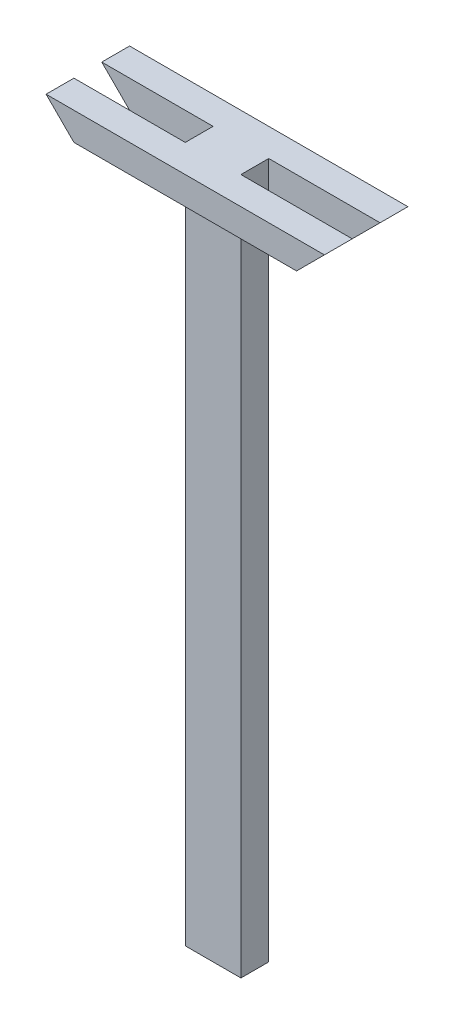
ISO-10303-21;
HEADER;
FILE_DESCRIPTION(('STEP AP214'),'2;1');
FILE_NAME('part.step','',(''),(''),'','','');
FILE_SCHEMA(('AUTOMOTIVE_DESIGN { 1 0 10303 214 1 1 1 1 }'));
ENDSEC;
DATA;
#1=APPLICATION_CONTEXT('core data for automotive mechanical design processes');
#2=APPLICATION_PROTOCOL_DEFINITION('international standard','automotive_design',2000,#1);
#3=PRODUCT_CONTEXT('',#1,'mechanical');
#4=PRODUCT('Part','Part','',(#3));
#5=PRODUCT_RELATED_PRODUCT_CATEGORY('part','',(#4));
#6=PRODUCT_DEFINITION_FORMATION('','',#4);
#7=PRODUCT_DEFINITION_CONTEXT('part definition',#1,'design');
#8=PRODUCT_DEFINITION('design','',#6,#7);
#9=PRODUCT_DEFINITION_SHAPE('','',#8);
#10=(LENGTH_UNIT() NAMED_UNIT(*) SI_UNIT(.MILLI.,.METRE.));
#11=(NAMED_UNIT(*) PLANE_ANGLE_UNIT() SI_UNIT($,.RADIAN.));
#12=(NAMED_UNIT(*) SI_UNIT($,.STERADIAN.) SOLID_ANGLE_UNIT());
#13=UNCERTAINTY_MEASURE_WITH_UNIT(LENGTH_MEASURE(1.E-05),#10,'distance_accuracy_value','');
#14=(GEOMETRIC_REPRESENTATION_CONTEXT(3) GLOBAL_UNCERTAINTY_ASSIGNED_CONTEXT((#13)) GLOBAL_UNIT_ASSIGNED_CONTEXT((#10,
#11,#12)) REPRESENTATION_CONTEXT('',''));
#15=CARTESIAN_POINT('',(0.,0.,0.));
#16=DIRECTION('',(0.,0.,1.));
#17=DIRECTION('',(1.,0.,0.));
#18=AXIS2_PLACEMENT_3D('',#15,#16,#17);
#19=CARTESIAN_POINT('',(0.,1000.,0.));
#20=DIRECTION('',(0.,0.,1.));
#21=DIRECTION('',(1.,0.,0.));
#22=AXIS2_PLACEMENT_3D('',#19,#20,#21);
#23=PLANE('',#22);
#24=DIRECTION('',(-1.,0.,0.));
#25=VECTOR('',#24,1.);
#26=CARTESIAN_POINT('',(240.,960.,0.));
#27=LINE('',#26,#25);
#28=CARTESIAN_POINT('',(80.,960.,0.));
#29=VERTEX_POINT('',#28);
#30=CARTESIAN_POINT('',(0.,960.,0.));
#31=VERTEX_POINT('',#30);
#32=EDGE_CURVE('E43',#29,#31,#27,.T.);
#33=ORIENTED_EDGE('',*,*,#32,.F.);
#34=DIRECTION('',(0.,-1.,0.));
#35=VECTOR('',#34,1.);
#36=CARTESIAN_POINT('',(80.,1000.,0.));
#37=LINE('',#36,#35);
#38=CARTESIAN_POINT('',(80.,0.,0.));
#39=VERTEX_POINT('',#38);
#40=EDGE_CURVE('E215',#29,#39,#37,.T.);
#41=ORIENTED_EDGE('',*,*,#40,.T.);
#42=DIRECTION('',(-1.,0.,0.));
#43=VECTOR('',#42,1.);
#44=CARTESIAN_POINT('',(0.,0.,0.));
#45=LINE('',#44,#43);
#46=CARTESIAN_POINT('',(0.,0.,0.));
#47=VERTEX_POINT('',#46);
#48=EDGE_CURVE('E200',#39,#47,#45,.T.);
#49=ORIENTED_EDGE('',*,*,#48,.T.);
#50=DIRECTION('',(0.,-1.,0.));
#51=VECTOR('',#50,1.);
#52=CARTESIAN_POINT('',(0.,1000.,0.));
#53=LINE('',#52,#51);
#54=EDGE_CURVE('E202',#31,#47,#53,.T.);
#55=ORIENTED_EDGE('',*,*,#54,.F.);
#56=EDGE_LOOP('',(#33,#41,#49,#55));
#57=FACE_BOUND('',#56,.T.);
#58=ADVANCED_FACE('F35',(#57),#23,.F.);
#59=CARTESIAN_POINT('',(0.,1000.,40.));
#60=DIRECTION('',(0.,0.,-1.));
#61=DIRECTION('',(-1.,0.,0.));
#62=AXIS2_PLACEMENT_3D('',#59,#60,#61);
#63=PLANE('',#62);
#64=DIRECTION('',(1.,0.,0.));
#65=VECTOR('',#64,1.);
#66=CARTESIAN_POINT('',(-160.,960.,40.));
#67=LINE('',#66,#65);
#68=CARTESIAN_POINT('',(0.,960.,40.));
#69=VERTEX_POINT('',#68);
#70=CARTESIAN_POINT('',(80.,960.,40.));
#71=VERTEX_POINT('',#70);
#72=EDGE_CURVE('E189',#69,#71,#67,.T.);
#73=ORIENTED_EDGE('',*,*,#72,.F.);
#74=DIRECTION('',(0.,-1.,0.));
#75=VECTOR('',#74,1.);
#76=CARTESIAN_POINT('',(0.,1000.,40.));
#77=LINE('',#76,#75);
#78=CARTESIAN_POINT('',(0.,0.,40.));
#79=VERTEX_POINT('',#78);
#80=EDGE_CURVE('E221',#69,#79,#77,.T.);
#81=ORIENTED_EDGE('',*,*,#80,.T.);
#82=DIRECTION('',(1.,0.,0.));
#83=VECTOR('',#82,1.);
#84=CARTESIAN_POINT('',(0.,0.,40.));
#85=LINE('',#84,#83);
#86=CARTESIAN_POINT('',(80.,0.,40.));
#87=VERTEX_POINT('',#86);
#88=EDGE_CURVE('E205',#79,#87,#85,.T.);
#89=ORIENTED_EDGE('',*,*,#88,.T.);
#90=DIRECTION('',(0.,-1.,0.));
#91=VECTOR('',#90,1.);
#92=CARTESIAN_POINT('',(80.,1000.,40.));
#93=LINE('',#92,#91);
#94=EDGE_CURVE('E219',#71,#87,#93,.T.);
#95=ORIENTED_EDGE('',*,*,#94,.F.);
#96=EDGE_LOOP('',(#73,#81,#89,#95));
#97=FACE_BOUND('',#96,.T.);
#98=ADVANCED_FACE('F233',(#97),#63,.F.);
#99=CARTESIAN_POINT('',(0.,1000.,0.));
#100=DIRECTION('',(1.,0.,0.));
#101=DIRECTION('',(0.,0.,-1.));
#102=AXIS2_PLACEMENT_3D('',#99,#100,#101);
#103=PLANE('',#102);
#104=DIRECTION('',(0.,0.,1.));
#105=VECTOR('',#104,1.);
#106=CARTESIAN_POINT('',(0.,0.,0.));
#107=LINE('',#106,#105);
#108=EDGE_CURVE('E196',#47,#79,#107,.T.);
#109=ORIENTED_EDGE('',*,*,#108,.T.);
#110=ORIENTED_EDGE('',*,*,#80,.F.);
#111=CARTESIAN_POINT('',(0.,1000.,40.));
#112=VERTEX_POINT('',#111);
#113=EDGE_CURVE('E222',#112,#69,#77,.T.);
#114=ORIENTED_EDGE('',*,*,#113,.F.);
#115=DIRECTION('',(0.,0.,1.));
#116=VECTOR('',#115,1.);
#117=CARTESIAN_POINT('',(0.,1000.,0.));
#118=LINE('',#117,#116);
#119=CARTESIAN_POINT('',(0.,1000.,0.));
#120=VERTEX_POINT('',#119);
#121=EDGE_CURVE('E197',#120,#112,#118,.T.);
#122=ORIENTED_EDGE('',*,*,#121,.F.);
#123=EDGE_CURVE('E213',#120,#31,#53,.T.);
#124=ORIENTED_EDGE('',*,*,#123,.T.);
#125=ORIENTED_EDGE('',*,*,#54,.T.);
#126=EDGE_LOOP('',(#109,#110,#114,#122,#124,#125));
#127=FACE_BOUND('',#126,.T.);
#128=ADVANCED_FACE('F37',(#127),#103,.F.);
#129=CARTESIAN_POINT('',(80.,1000.,0.));
#130=DIRECTION('',(-1.,0.,0.));
#131=DIRECTION('',(0.,0.,1.));
#132=AXIS2_PLACEMENT_3D('',#129,#130,#131);
#133=PLANE('',#132);
#134=DIRECTION('',(0.,0.,-1.));
#135=VECTOR('',#134,1.);
#136=CARTESIAN_POINT('',(80.,0.,0.));
#137=LINE('',#136,#135);
#138=EDGE_CURVE('E208',#87,#39,#137,.T.);
#139=ORIENTED_EDGE('',*,*,#138,.T.);
#140=ORIENTED_EDGE('',*,*,#40,.F.);
#141=CARTESIAN_POINT('',(80.,1000.,0.));
#142=VERTEX_POINT('',#141);
#143=EDGE_CURVE('E216',#142,#29,#37,.T.);
#144=ORIENTED_EDGE('',*,*,#143,.F.);
#145=DIRECTION('',(0.,0.,-1.));
#146=VECTOR('',#145,1.);
#147=CARTESIAN_POINT('',(80.,1000.,0.));
#148=LINE('',#147,#146);
#149=CARTESIAN_POINT('',(80.,1000.,40.));
#150=VERTEX_POINT('',#149);
#151=EDGE_CURVE('E199',#150,#142,#148,.T.);
#152=ORIENTED_EDGE('',*,*,#151,.F.);
#153=EDGE_CURVE('E220',#150,#71,#93,.T.);
#154=ORIENTED_EDGE('',*,*,#153,.T.);
#155=ORIENTED_EDGE('',*,*,#94,.T.);
#156=EDGE_LOOP('',(#139,#140,#144,#152,#154,#155));
#157=FACE_BOUND('',#156,.T.);
#158=ADVANCED_FACE('F248',(#157),#133,.F.);
#159=CARTESIAN_POINT('',(0.,1000.,0.));
#160=DIRECTION('',(0.,1.,0.));
#161=DIRECTION('',(0.,0.,1.));
#162=AXIS2_PLACEMENT_3D('',#159,#160,#161);
#163=PLANE('',#162);
#164=ORIENTED_EDGE('',*,*,#121,.T.);
#165=DIRECTION('',(-1.,0.,0.));
#166=VECTOR('',#165,1.);
#167=CARTESIAN_POINT('',(-160.,1000.,40.));
#168=LINE('',#167,#166);
#169=CARTESIAN_POINT('',(-160.,1000.,40.));
#170=VERTEX_POINT('',#169);
#171=EDGE_CURVE('E188',#112,#170,#168,.T.);
#172=ORIENTED_EDGE('',*,*,#171,.T.);
#173=DIRECTION('',(0.,0.,-1.));
#174=VECTOR('',#173,1.);
#175=CARTESIAN_POINT('',(-160.,1000.,80.));
#176=LINE('',#175,#174);
#177=CARTESIAN_POINT('',(-160.,1000.,80.));
#178=VERTEX_POINT('',#177);
#179=EDGE_CURVE('E185',#178,#170,#176,.T.);
#180=ORIENTED_EDGE('',*,*,#179,.F.);
#181=DIRECTION('',(-1.,0.,0.));
#182=VECTOR('',#181,1.);
#183=CARTESIAN_POINT('',(-160.,1000.,80.));
#184=LINE('',#183,#182);
#185=CARTESIAN_POINT('',(240.,1000.,80.));
#186=VERTEX_POINT('',#185);
#187=EDGE_CURVE('E181',#186,#178,#184,.T.);
#188=ORIENTED_EDGE('',*,*,#187,.F.);
#189=DIRECTION('',(0.,0.,-1.));
#190=VECTOR('',#189,1.);
#191=CARTESIAN_POINT('',(240.,1000.,80.));
#192=LINE('',#191,#190);
#193=CARTESIAN_POINT('',(240.,1000.,40.));
#194=VERTEX_POINT('',#193);
#195=EDGE_CURVE('E193',#186,#194,#192,.T.);
#196=ORIENTED_EDGE('',*,*,#195,.T.);
#197=EDGE_CURVE('E182',#194,#150,#168,.T.);
#198=ORIENTED_EDGE('',*,*,#197,.T.);
#199=ORIENTED_EDGE('',*,*,#151,.T.);
#200=DIRECTION('',(1.,0.,0.));
#201=VECTOR('',#200,1.);
#202=CARTESIAN_POINT('',(240.,1000.,0.));
#203=LINE('',#202,#201);
#204=CARTESIAN_POINT('',(240.,1000.,0.));
#205=VERTEX_POINT('',#204);
#206=EDGE_CURVE('E167',#142,#205,#203,.T.);
#207=ORIENTED_EDGE('',*,*,#206,.T.);
#208=DIRECTION('',(0.,0.,1.));
#209=VECTOR('',#208,1.);
#210=CARTESIAN_POINT('',(240.,1000.,-40.));
#211=LINE('',#210,#209);
#212=CARTESIAN_POINT('',(240.,1000.,-40.));
#213=VERTEX_POINT('',#212);
#214=EDGE_CURVE('E164',#213,#205,#211,.T.);
#215=ORIENTED_EDGE('',*,*,#214,.F.);
#216=DIRECTION('',(1.,0.,0.));
#217=VECTOR('',#216,1.);
#218=CARTESIAN_POINT('',(240.,1000.,-40.));
#219=LINE('',#218,#217);
#220=CARTESIAN_POINT('',(-160.,1000.,-40.));
#221=VERTEX_POINT('',#220);
#222=EDGE_CURVE('E161',#221,#213,#219,.T.);
#223=ORIENTED_EDGE('',*,*,#222,.F.);
#224=DIRECTION('',(0.,0.,1.));
#225=VECTOR('',#224,1.);
#226=CARTESIAN_POINT('',(-160.,1000.,-40.));
#227=LINE('',#226,#225);
#228=CARTESIAN_POINT('',(-160.,1000.,0.));
#229=VERTEX_POINT('',#228);
#230=EDGE_CURVE('E140',#221,#229,#227,.T.);
#231=ORIENTED_EDGE('',*,*,#230,.T.);
#232=EDGE_CURVE('E162',#229,#120,#203,.T.);
#233=ORIENTED_EDGE('',*,*,#232,.T.);
#234=EDGE_LOOP('',(#164,#172,#180,#188,#196,#198,#199,#207,#215,#223,#231,#233));
#235=FACE_BOUND('',#234,.T.);
#236=ADVANCED_FACE('F265',(#235),#163,.T.);
#237=CARTESIAN_POINT('',(0.,0.,0.));
#238=DIRECTION('',(0.,1.,0.));
#239=DIRECTION('',(0.,0.,1.));
#240=AXIS2_PLACEMENT_3D('',#237,#238,#239);
#241=PLANE('',#240);
#242=ORIENTED_EDGE('',*,*,#108,.F.);
#243=ORIENTED_EDGE('',*,*,#48,.F.);
#244=ORIENTED_EDGE('',*,*,#138,.F.);
#245=ORIENTED_EDGE('',*,*,#88,.F.);
#246=EDGE_LOOP('',(#242,#243,#244,#245));
#247=FACE_BOUND('',#246,.T.);
#248=ADVANCED_FACE('F239',(#247),#241,.F.);
#249=CARTESIAN_POINT('',(0.,0.,40.));
#250=DIRECTION('',(0.,0.,1.));
#251=DIRECTION('',(1.,0.,0.));
#252=AXIS2_PLACEMENT_3D('',#249,#250,#251);
#253=PLANE('',#252);
#254=CARTESIAN_POINT('',(-120.,960.,40.));
#255=VERTEX_POINT('',#254);
#256=EDGE_CURVE('E186',#255,#69,#67,.T.);
#257=ORIENTED_EDGE('',*,*,#256,.F.);
#258=DIRECTION('',(-0.707106781186549,0.707106781186546,0.));
#259=VECTOR('',#258,1.);
#260=CARTESIAN_POINT('',(420.,420.000000000003,40.));
#261=LINE('',#260,#259);
#262=EDGE_CURVE('E156',#255,#170,#261,.T.);
#263=ORIENTED_EDGE('',*,*,#262,.T.);
#264=ORIENTED_EDGE('',*,*,#171,.F.);
#265=ORIENTED_EDGE('',*,*,#113,.T.);
#266=EDGE_LOOP('',(#257,#263,#264,#265));
#267=FACE_BOUND('',#266,.T.);
#268=ADVANCED_FACE('F259',(#267),#253,.F.);
#269=CARTESIAN_POINT('',(-160.,960.,80.));
#270=DIRECTION('',(0.,1.,0.));
#271=DIRECTION('',(0.,0.,1.));
#272=AXIS2_PLACEMENT_3D('',#269,#270,#271);
#273=PLANE('',#272);
#274=DIRECTION('',(1.,0.,0.));
#275=VECTOR('',#274,1.);
#276=CARTESIAN_POINT('',(-160.,960.,80.));
#277=LINE('',#276,#275);
#278=CARTESIAN_POINT('',(-120.,960.,80.));
#279=VERTEX_POINT('',#278);
#280=CARTESIAN_POINT('',(200.000000000001,960.,80.));
#281=VERTEX_POINT('',#280);
#282=EDGE_CURVE('E178',#279,#281,#277,.T.);
#283=ORIENTED_EDGE('',*,*,#282,.F.);
#284=DIRECTION('',(0.,0.,1.));
#285=VECTOR('',#284,1.);
#286=CARTESIAN_POINT('',(-120.,960.,-40.));
#287=LINE('',#286,#285);
#288=EDGE_CURVE('E50',#255,#279,#287,.T.);
#289=ORIENTED_EDGE('',*,*,#288,.F.);
#290=ORIENTED_EDGE('',*,*,#256,.T.);
#291=ORIENTED_EDGE('',*,*,#72,.T.);
#292=CARTESIAN_POINT('',(200.000000000001,960.,40.));
#293=VERTEX_POINT('',#292);
#294=EDGE_CURVE('E177',#71,#293,#67,.T.);
#295=ORIENTED_EDGE('',*,*,#294,.T.);
#296=DIRECTION('',(0.,0.,1.));
#297=VECTOR('',#296,1.);
#298=CARTESIAN_POINT('',(200.000000000001,960.,-40.));
#299=LINE('',#298,#297);
#300=EDGE_CURVE('E58',#293,#281,#299,.T.);
#301=ORIENTED_EDGE('',*,*,#300,.T.);
#302=EDGE_LOOP('',(#283,#289,#290,#291,#295,#301));
#303=FACE_BOUND('',#302,.T.);
#304=ADVANCED_FACE('F257',(#303),#273,.F.);
#305=CARTESIAN_POINT('',(0.,0.,80.));
#306=DIRECTION('',(0.,0.,1.));
#307=DIRECTION('',(1.,0.,0.));
#308=AXIS2_PLACEMENT_3D('',#305,#306,#307);
#309=PLANE('',#308);
#310=DIRECTION('',(-0.707106781186549,0.707106781186546,0.));
#311=VECTOR('',#310,1.);
#312=CARTESIAN_POINT('',(-160.,1000.,80.));
#313=LINE('',#312,#311);
#314=EDGE_CURVE('E145',#279,#178,#313,.T.);
#315=ORIENTED_EDGE('',*,*,#314,.F.);
#316=ORIENTED_EDGE('',*,*,#282,.T.);
#317=DIRECTION('',(-0.707106781186542,-0.707106781186553,0.));
#318=VECTOR('',#317,1.);
#319=CARTESIAN_POINT('',(240.,1000.,80.));
#320=LINE('',#319,#318);
#321=EDGE_CURVE('E280',#186,#281,#320,.T.);
#322=ORIENTED_EDGE('',*,*,#321,.F.);
#323=ORIENTED_EDGE('',*,*,#187,.T.);
#324=EDGE_LOOP('',(#315,#316,#322,#323));
#325=FACE_BOUND('',#324,.T.);
#326=ADVANCED_FACE('F282',(#325),#309,.T.);
#327=ORIENTED_EDGE('',*,*,#197,.F.);
#328=DIRECTION('',(-0.707106781186542,-0.707106781186553,0.));
#329=VECTOR('',#328,1.);
#330=CARTESIAN_POINT('',(-379.999999999998,379.999999999992,40.));
#331=LINE('',#330,#329);
#332=EDGE_CURVE('E170',#194,#293,#331,.T.);
#333=ORIENTED_EDGE('',*,*,#332,.T.);
#334=ORIENTED_EDGE('',*,*,#294,.F.);
#335=ORIENTED_EDGE('',*,*,#153,.F.);
#336=EDGE_LOOP('',(#327,#333,#334,#335));
#337=FACE_BOUND('',#336,.T.);
#338=ADVANCED_FACE('F254',(#337),#253,.F.);
#339=CARTESIAN_POINT('',(0.,0.,0.));
#340=DIRECTION('',(0.,0.,-1.));
#341=DIRECTION('',(-1.,0.,0.));
#342=AXIS2_PLACEMENT_3D('',#339,#340,#341);
#343=PLANE('',#342);
#344=CARTESIAN_POINT('',(200.000000000001,960.,0.));
#345=VERTEX_POINT('',#344);
#346=EDGE_CURVE('E173',#345,#29,#27,.T.);
#347=ORIENTED_EDGE('',*,*,#346,.F.);
#348=DIRECTION('',(0.707106781186542,0.707106781186553,0.));
#349=VECTOR('',#348,1.);
#350=CARTESIAN_POINT('',(-379.999999999998,379.999999999992,0.));
#351=LINE('',#350,#349);
#352=EDGE_CURVE('E261',#345,#205,#351,.T.);
#353=ORIENTED_EDGE('',*,*,#352,.T.);
#354=ORIENTED_EDGE('',*,*,#206,.F.);
#355=ORIENTED_EDGE('',*,*,#143,.T.);
#356=EDGE_LOOP('',(#347,#353,#354,#355));
#357=FACE_BOUND('',#356,.T.);
#358=ADVANCED_FACE('F274',(#357),#343,.F.);
#359=CARTESIAN_POINT('',(240.,960.,-40.));
#360=DIRECTION('',(0.,1.,0.));
#361=DIRECTION('',(0.,0.,1.));
#362=AXIS2_PLACEMENT_3D('',#359,#360,#361);
#363=PLANE('',#362);
#364=CARTESIAN_POINT('',(-120.,960.,0.));
#365=VERTEX_POINT('',#364);
#366=EDGE_CURVE('E155',#31,#365,#27,.T.);
#367=ORIENTED_EDGE('',*,*,#366,.T.);
#368=CARTESIAN_POINT('',(-120.,960.,-40.));
#369=VERTEX_POINT('',#368);
#370=EDGE_CURVE('E138',#369,#365,#287,.T.);
#371=ORIENTED_EDGE('',*,*,#370,.F.);
#372=DIRECTION('',(-1.,0.,0.));
#373=VECTOR('',#372,1.);
#374=CARTESIAN_POINT('',(240.,960.,-40.));
#375=LINE('',#374,#373);
#376=CARTESIAN_POINT('',(200.000000000001,960.,-40.));
#377=VERTEX_POINT('',#376);
#378=EDGE_CURVE('E152',#377,#369,#375,.T.);
#379=ORIENTED_EDGE('',*,*,#378,.F.);
#380=EDGE_CURVE('E271',#377,#345,#299,.T.);
#381=ORIENTED_EDGE('',*,*,#380,.T.);
#382=ORIENTED_EDGE('',*,*,#346,.T.);
#383=ORIENTED_EDGE('',*,*,#32,.T.);
#384=EDGE_LOOP('',(#367,#371,#379,#381,#382,#383));
#385=FACE_BOUND('',#384,.T.);
#386=ADVANCED_FACE('F150',(#385),#363,.F.);
#387=CARTESIAN_POINT('',(0.,0.,-40.));
#388=DIRECTION('',(0.,0.,-1.));
#389=DIRECTION('',(-1.,0.,0.));
#390=AXIS2_PLACEMENT_3D('',#387,#388,#389);
#391=PLANE('',#390);
#392=DIRECTION('',(-0.707106781186549,0.707106781186546,0.));
#393=VECTOR('',#392,1.);
#394=CARTESIAN_POINT('',(-160.,1000.,-40.));
#395=LINE('',#394,#393);
#396=EDGE_CURVE('E135',#369,#221,#395,.T.);
#397=ORIENTED_EDGE('',*,*,#396,.T.);
#398=ORIENTED_EDGE('',*,*,#222,.T.);
#399=DIRECTION('',(-0.707106781186542,-0.707106781186553,0.));
#400=VECTOR('',#399,1.);
#401=CARTESIAN_POINT('',(240.,1000.,-40.));
#402=LINE('',#401,#400);
#403=EDGE_CURVE('E160',#213,#377,#402,.T.);
#404=ORIENTED_EDGE('',*,*,#403,.T.);
#405=ORIENTED_EDGE('',*,*,#378,.T.);
#406=EDGE_LOOP('',(#397,#398,#404,#405));
#407=FACE_BOUND('',#406,.T.);
#408=ADVANCED_FACE('F159',(#407),#391,.T.);
#409=ORIENTED_EDGE('',*,*,#232,.F.);
#410=DIRECTION('',(0.707106781186549,-0.707106781186546,0.));
#411=VECTOR('',#410,1.);
#412=CARTESIAN_POINT('',(420.,420.000000000003,0.));
#413=LINE('',#412,#411);
#414=EDGE_CURVE('E11',#229,#365,#413,.T.);
#415=ORIENTED_EDGE('',*,*,#414,.T.);
#416=ORIENTED_EDGE('',*,*,#366,.F.);
#417=ORIENTED_EDGE('',*,*,#123,.F.);
#418=EDGE_LOOP('',(#409,#415,#416,#417));
#419=FACE_BOUND('',#418,.T.);
#420=ADVANCED_FACE('F269',(#419),#343,.F.);
#421=CARTESIAN_POINT('',(-160.,1000.,-40.));
#422=DIRECTION('',(0.707106781186546,0.707106781186549,0.));
#423=DIRECTION('',(-0.707106781186549,0.707106781186546,0.));
#424=AXIS2_PLACEMENT_3D('',#421,#422,#423);
#425=PLANE('',#424);
#426=ORIENTED_EDGE('',*,*,#230,.F.);
#427=ORIENTED_EDGE('',*,*,#396,.F.);
#428=ORIENTED_EDGE('',*,*,#370,.T.);
#429=ORIENTED_EDGE('',*,*,#414,.F.);
#430=EDGE_LOOP('',(#426,#427,#428,#429));
#431=FACE_BOUND('',#430,.T.);
#432=ADVANCED_FACE('F137',(#431),#425,.F.);
#433=CARTESIAN_POINT('',(240.,1000.,-40.));
#434=DIRECTION('',(-0.707106781186553,0.707106781186542,0.));
#435=DIRECTION('',(-0.707106781186542,-0.707106781186553,0.));
#436=AXIS2_PLACEMENT_3D('',#433,#434,#435);
#437=PLANE('',#436);
#438=ORIENTED_EDGE('',*,*,#380,.F.);
#439=ORIENTED_EDGE('',*,*,#403,.F.);
#440=ORIENTED_EDGE('',*,*,#214,.T.);
#441=ORIENTED_EDGE('',*,*,#352,.F.);
#442=EDGE_LOOP('',(#438,#439,#440,#441));
#443=FACE_BOUND('',#442,.T.);
#444=ADVANCED_FACE('F293',(#443),#437,.F.);
#445=ORIENTED_EDGE('',*,*,#195,.F.);
#446=ORIENTED_EDGE('',*,*,#321,.T.);
#447=ORIENTED_EDGE('',*,*,#300,.F.);
#448=ORIENTED_EDGE('',*,*,#332,.F.);
#449=EDGE_LOOP('',(#445,#446,#447,#448));
#450=FACE_BOUND('',#449,.T.);
#451=ADVANCED_FACE('F279',(#450),#437,.F.);
#452=ORIENTED_EDGE('',*,*,#288,.T.);
#453=ORIENTED_EDGE('',*,*,#314,.T.);
#454=ORIENTED_EDGE('',*,*,#179,.T.);
#455=ORIENTED_EDGE('',*,*,#262,.F.);
#456=EDGE_LOOP('',(#452,#453,#454,#455));
#457=FACE_BOUND('',#456,.T.);
#458=ADVANCED_FACE('F287',(#457),#425,.F.);
#459=CLOSED_SHELL('',(#58,#98,#128,#158,#236,#248,#268,#304,#326,#338,#358,#386,#408,#420,#432,
#444,#451,#458));
#460=MANIFOLD_SOLID_BREP('B2',#459);
#461=ADVANCED_BREP_SHAPE_REPRESENTATION('',(#18,#460),#14);
#462=SHAPE_DEFINITION_REPRESENTATION(#9,#461);
ENDSEC;
END-ISO-10303-21;
